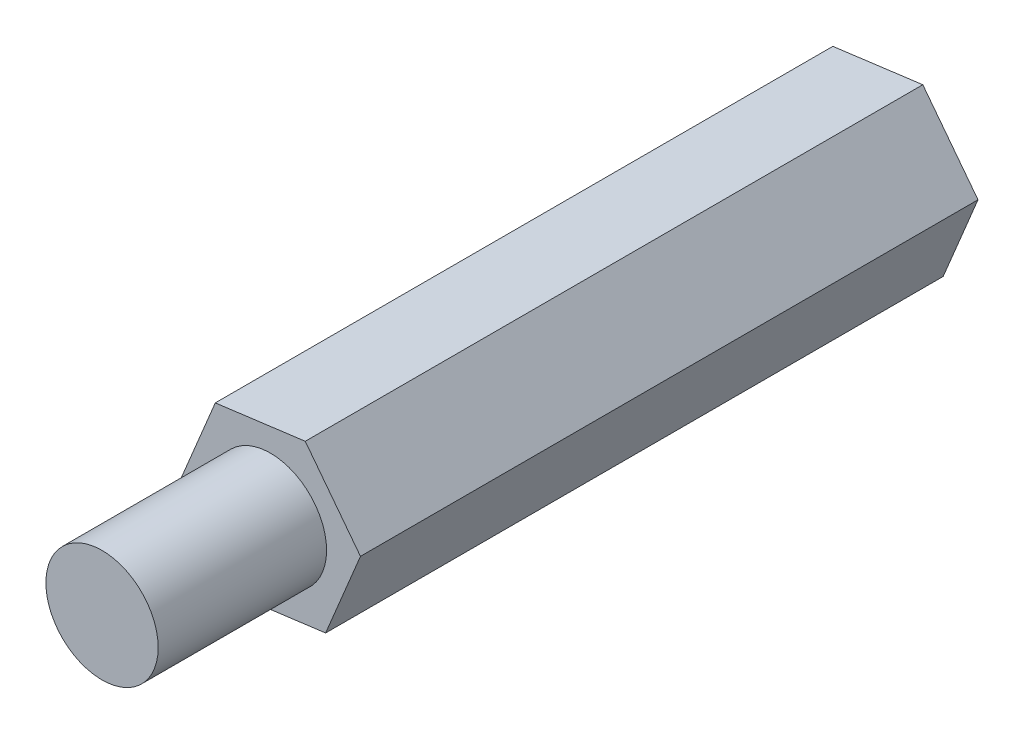
ISO-10303-21;
HEADER;
FILE_DESCRIPTION(('STEP AP214'),'2;1');
FILE_NAME('part.step','',(''),(''),'','','');
FILE_SCHEMA(('AUTOMOTIVE_DESIGN { 1 0 10303 214 1 1 1 1 }'));
ENDSEC;
DATA;
#1=APPLICATION_CONTEXT('core data for automotive mechanical design processes');
#2=APPLICATION_PROTOCOL_DEFINITION('international standard','automotive_design',2000,#1);
#3=PRODUCT_CONTEXT('',#1,'mechanical');
#4=PRODUCT('Part','Part','',(#3));
#5=PRODUCT_RELATED_PRODUCT_CATEGORY('part','',(#4));
#6=PRODUCT_DEFINITION_FORMATION('','',#4);
#7=PRODUCT_DEFINITION_CONTEXT('part definition',#1,'design');
#8=PRODUCT_DEFINITION('design','',#6,#7);
#9=PRODUCT_DEFINITION_SHAPE('','',#8);
#10=(LENGTH_UNIT() NAMED_UNIT(*) SI_UNIT(.MILLI.,.METRE.));
#11=(NAMED_UNIT(*) PLANE_ANGLE_UNIT() SI_UNIT($,.RADIAN.));
#12=(NAMED_UNIT(*) SI_UNIT($,.STERADIAN.) SOLID_ANGLE_UNIT());
#13=UNCERTAINTY_MEASURE_WITH_UNIT(LENGTH_MEASURE(1.E-05),#10,'distance_accuracy_value','');
#14=(GEOMETRIC_REPRESENTATION_CONTEXT(3) GLOBAL_UNCERTAINTY_ASSIGNED_CONTEXT((#13)) GLOBAL_UNIT_ASSIGNED_CONTEXT((#10,
#11,#12)) REPRESENTATION_CONTEXT('',''));
#15=CARTESIAN_POINT('',(0.,0.,0.));
#16=DIRECTION('',(0.,0.,1.));
#17=DIRECTION('',(1.,0.,0.));
#18=AXIS2_PLACEMENT_3D('',#15,#16,#17);
#19=CARTESIAN_POINT('',(-0.620107089526778,-1.49291678631194,11.));
#20=DIRECTION('',(-0.129551152997213,0.991572740023188,0.));
#21=DIRECTION('',(-0.991572740023188,-0.129551152997213,0.));
#22=AXIS2_PLACEMENT_3D('',#19,#20,#21);
#23=PLANE('',#22);
#24=DIRECTION('',(0.991572740023188,0.129551152997213,0.));
#25=VECTOR('',#24,1.);
#26=CARTESIAN_POINT('',(-0.620107089526778,-1.49291678631194,0.));
#27=LINE('',#26,#25);
#28=CARTESIAN_POINT('',(-0.620107089526778,-1.49291678631194,0.));
#29=VERTEX_POINT('',#28);
#30=CARTESIAN_POINT('',(0.982850317918974,-1.28348688575299,0.));
#31=VERTEX_POINT('',#30);
#32=EDGE_CURVE('E123',#29,#31,#27,.T.);
#33=ORIENTED_EDGE('',*,*,#32,.T.);
#34=DIRECTION('',(0.,0.,-1.));
#35=VECTOR('',#34,1.);
#36=CARTESIAN_POINT('',(0.982850317918974,-1.28348688575299,11.));
#37=LINE('',#36,#35);
#38=CARTESIAN_POINT('',(0.982850317918974,-1.28348688575299,11.));
#39=VERTEX_POINT('',#38);
#40=EDGE_CURVE('E40',#39,#31,#37,.T.);
#41=ORIENTED_EDGE('',*,*,#40,.F.);
#42=DIRECTION('',(0.991572740023188,0.129551152997213,0.));
#43=VECTOR('',#42,1.);
#44=CARTESIAN_POINT('',(-0.620107089526778,-1.49291678631194,11.));
#45=LINE('',#44,#43);
#46=CARTESIAN_POINT('',(-0.620107089526778,-1.49291678631194,11.));
#47=VERTEX_POINT('',#46);
#48=EDGE_CURVE('E134',#47,#39,#45,.T.);
#49=ORIENTED_EDGE('',*,*,#48,.F.);
#50=DIRECTION('',(0.,0.,-1.));
#51=VECTOR('',#50,1.);
#52=CARTESIAN_POINT('',(-0.620107089526778,-1.49291678631194,11.));
#53=LINE('',#52,#51);
#54=EDGE_CURVE('E119',#47,#29,#53,.T.);
#55=ORIENTED_EDGE('',*,*,#54,.T.);
#56=EDGE_LOOP('',(#33,#41,#49,#55));
#57=FACE_BOUND('',#56,.T.);
#58=ADVANCED_FACE('F37',(#57),#23,.F.);
#59=CARTESIAN_POINT('',(0.982850317918974,-1.28348688575299,11.));
#60=DIRECTION('',(-0.92350275905883,0.383591780426443,0.));
#61=DIRECTION('',(-0.383591780426443,-0.92350275905883,0.));
#62=AXIS2_PLACEMENT_3D('',#59,#60,#61);
#63=PLANE('',#62);
#64=DIRECTION('',(0.383591780426443,0.92350275905883,0.));
#65=VECTOR('',#64,1.);
#66=CARTESIAN_POINT('',(0.982850317918974,-1.28348688575299,0.));
#67=LINE('',#66,#65);
#68=CARTESIAN_POINT('',(1.60295740744575,0.209429900558949,0.));
#69=VERTEX_POINT('',#68);
#70=EDGE_CURVE('E126',#31,#69,#67,.T.);
#71=ORIENTED_EDGE('',*,*,#70,.T.);
#72=DIRECTION('',(0.,0.,-1.));
#73=VECTOR('',#72,1.);
#74=CARTESIAN_POINT('',(1.60295740744575,0.209429900558949,11.));
#75=LINE('',#74,#73);
#76=CARTESIAN_POINT('',(1.60295740744575,0.209429900558949,11.));
#77=VERTEX_POINT('',#76);
#78=EDGE_CURVE('E137',#77,#69,#75,.T.);
#79=ORIENTED_EDGE('',*,*,#78,.F.);
#80=DIRECTION('',(0.383591780426443,0.92350275905883,0.));
#81=VECTOR('',#80,1.);
#82=CARTESIAN_POINT('',(0.982850317918974,-1.28348688575299,11.));
#83=LINE('',#82,#81);
#84=EDGE_CURVE('E92',#39,#77,#83,.T.);
#85=ORIENTED_EDGE('',*,*,#84,.F.);
#86=ORIENTED_EDGE('',*,*,#40,.T.);
#87=EDGE_LOOP('',(#71,#79,#85,#86));
#88=FACE_BOUND('',#87,.T.);
#89=ADVANCED_FACE('F142',(#88),#63,.F.);
#90=CARTESIAN_POINT('',(1.60295740744575,0.209429900558949,11.));
#91=DIRECTION('',(-0.793951606061617,-0.607980959596745,0.));
#92=DIRECTION('',(0.607980959596745,-0.793951606061617,0.));
#93=AXIS2_PLACEMENT_3D('',#90,#91,#92);
#94=PLANE('',#93);
#95=DIRECTION('',(-0.607980959596745,0.793951606061617,0.));
#96=VECTOR('',#95,1.);
#97=CARTESIAN_POINT('',(1.60295740744575,0.209429900558949,0.));
#98=LINE('',#97,#96);
#99=CARTESIAN_POINT('',(0.620107089526777,1.49291678631194,0.));
#100=VERTEX_POINT('',#99);
#101=EDGE_CURVE('E129',#69,#100,#98,.T.);
#102=ORIENTED_EDGE('',*,*,#101,.T.);
#103=DIRECTION('',(0.,0.,-1.));
#104=VECTOR('',#103,1.);
#105=CARTESIAN_POINT('',(0.620107089526777,1.49291678631194,11.));
#106=LINE('',#105,#104);
#107=CARTESIAN_POINT('',(0.620107089526777,1.49291678631194,11.));
#108=VERTEX_POINT('',#107);
#109=EDGE_CURVE('E114',#108,#100,#106,.T.);
#110=ORIENTED_EDGE('',*,*,#109,.F.);
#111=DIRECTION('',(-0.607980959596745,0.793951606061617,0.));
#112=VECTOR('',#111,1.);
#113=CARTESIAN_POINT('',(1.60295740744575,0.209429900558949,11.));
#114=LINE('',#113,#112);
#115=EDGE_CURVE('E105',#77,#108,#114,.T.);
#116=ORIENTED_EDGE('',*,*,#115,.F.);
#117=ORIENTED_EDGE('',*,*,#78,.T.);
#118=EDGE_LOOP('',(#102,#110,#116,#117));
#119=FACE_BOUND('',#118,.T.);
#120=ADVANCED_FACE('F148',(#119),#94,.F.);
#121=CARTESIAN_POINT('',(0.620107089526777,1.49291678631194,11.));
#122=DIRECTION('',(0.129551152997213,-0.991572740023188,0.));
#123=DIRECTION('',(0.991572740023188,0.129551152997213,0.));
#124=AXIS2_PLACEMENT_3D('',#121,#122,#123);
#125=PLANE('',#124);
#126=DIRECTION('',(-0.991572740023188,-0.129551152997213,0.));
#127=VECTOR('',#126,1.);
#128=CARTESIAN_POINT('',(0.620107089526777,1.49291678631194,0.));
#129=LINE('',#128,#127);
#130=CARTESIAN_POINT('',(-0.982850317918973,1.28348688575299,0.));
#131=VERTEX_POINT('',#130);
#132=EDGE_CURVE('E113',#100,#131,#129,.T.);
#133=ORIENTED_EDGE('',*,*,#132,.T.);
#134=DIRECTION('',(0.,0.,-1.));
#135=VECTOR('',#134,1.);
#136=CARTESIAN_POINT('',(-0.982850317918973,1.28348688575299,11.));
#137=LINE('',#136,#135);
#138=CARTESIAN_POINT('',(-0.982850317918973,1.28348688575299,11.));
#139=VERTEX_POINT('',#138);
#140=EDGE_CURVE('E110',#139,#131,#137,.T.);
#141=ORIENTED_EDGE('',*,*,#140,.F.);
#142=DIRECTION('',(-0.991572740023188,-0.129551152997213,0.));
#143=VECTOR('',#142,1.);
#144=CARTESIAN_POINT('',(0.620107089526777,1.49291678631194,11.));
#145=LINE('',#144,#143);
#146=EDGE_CURVE('E99',#108,#139,#145,.T.);
#147=ORIENTED_EDGE('',*,*,#146,.F.);
#148=ORIENTED_EDGE('',*,*,#109,.T.);
#149=EDGE_LOOP('',(#133,#141,#147,#148));
#150=FACE_BOUND('',#149,.T.);
#151=ADVANCED_FACE('F111',(#150),#125,.F.);
#152=CARTESIAN_POINT('',(-0.982850317918973,1.28348688575299,11.));
#153=DIRECTION('',(0.92350275905883,-0.383591780426443,0.));
#154=DIRECTION('',(0.383591780426443,0.92350275905883,0.));
#155=AXIS2_PLACEMENT_3D('',#152,#153,#154);
#156=PLANE('',#155);
#157=DIRECTION('',(-0.383591780426443,-0.92350275905883,0.));
#158=VECTOR('',#157,1.);
#159=CARTESIAN_POINT('',(-0.982850317918973,1.28348688575299,0.));
#160=LINE('',#159,#158);
#161=CARTESIAN_POINT('',(-1.60295740744575,-0.209429900558948,0.));
#162=VERTEX_POINT('',#161);
#163=EDGE_CURVE('E77',#131,#162,#160,.T.);
#164=ORIENTED_EDGE('',*,*,#163,.T.);
#165=DIRECTION('',(0.,0.,-1.));
#166=VECTOR('',#165,1.);
#167=CARTESIAN_POINT('',(-1.60295740744575,-0.209429900558948,11.));
#168=LINE('',#167,#166);
#169=CARTESIAN_POINT('',(-1.60295740744575,-0.209429900558948,11.));
#170=VERTEX_POINT('',#169);
#171=EDGE_CURVE('E115',#170,#162,#168,.T.);
#172=ORIENTED_EDGE('',*,*,#171,.F.);
#173=DIRECTION('',(-0.383591780426443,-0.92350275905883,0.));
#174=VECTOR('',#173,1.);
#175=CARTESIAN_POINT('',(-0.982850317918973,1.28348688575299,11.));
#176=LINE('',#175,#174);
#177=EDGE_CURVE('E103',#139,#170,#176,.T.);
#178=ORIENTED_EDGE('',*,*,#177,.F.);
#179=ORIENTED_EDGE('',*,*,#140,.T.);
#180=EDGE_LOOP('',(#164,#172,#178,#179));
#181=FACE_BOUND('',#180,.T.);
#182=ADVANCED_FACE('F117',(#181),#156,.F.);
#183=CARTESIAN_POINT('',(-1.60295740744575,-0.209429900558948,11.));
#184=DIRECTION('',(0.793951606061617,0.607980959596745,0.));
#185=DIRECTION('',(-0.607980959596745,0.793951606061618,0.));
#186=AXIS2_PLACEMENT_3D('',#183,#184,#185);
#187=PLANE('',#186);
#188=DIRECTION('',(0.607980959596745,-0.793951606061617,0.));
#189=VECTOR('',#188,1.);
#190=CARTESIAN_POINT('',(-1.60295740744575,-0.209429900558948,0.));
#191=LINE('',#190,#189);
#192=EDGE_CURVE('E83',#162,#29,#191,.T.);
#193=ORIENTED_EDGE('',*,*,#192,.T.);
#194=ORIENTED_EDGE('',*,*,#54,.F.);
#195=DIRECTION('',(0.607980959596745,-0.793951606061617,0.));
#196=VECTOR('',#195,1.);
#197=CARTESIAN_POINT('',(-1.60295740744575,-0.209429900558948,11.));
#198=LINE('',#197,#196);
#199=EDGE_CURVE('E54',#170,#47,#198,.T.);
#200=ORIENTED_EDGE('',*,*,#199,.F.);
#201=ORIENTED_EDGE('',*,*,#171,.T.);
#202=EDGE_LOOP('',(#193,#194,#200,#201));
#203=FACE_BOUND('',#202,.T.);
#204=ADVANCED_FACE('F179',(#203),#187,.F.);
#205=CARTESIAN_POINT('',(0.,0.,11.));
#206=DIRECTION('',(0.,0.,1.));
#207=DIRECTION('',(1.,0.,0.));
#208=AXIS2_PLACEMENT_3D('',#205,#206,#207);
#209=PLANE('',#208);
#210=CARTESIAN_POINT('',(0.,0.,11.));
#211=DIRECTION('',(0.,0.,1.));
#212=DIRECTION('',(1.,0.,0.));
#213=AXIS2_PLACEMENT_3D('',#210,#211,#212);
#214=CIRCLE('',#213,1.);
#215=CARTESIAN_POINT('',(1.,0.,11.));
#216=VERTEX_POINT('',#215);
#217=EDGE_CURVE('E11',#216,#216,#214,.T.);
#218=ORIENTED_EDGE('',*,*,#217,.F.);
#219=EDGE_LOOP('',(#218));
#220=FACE_BOUND('',#219,.T.);
#221=ORIENTED_EDGE('',*,*,#48,.T.);
#222=ORIENTED_EDGE('',*,*,#84,.T.);
#223=ORIENTED_EDGE('',*,*,#115,.T.);
#224=ORIENTED_EDGE('',*,*,#146,.T.);
#225=ORIENTED_EDGE('',*,*,#177,.T.);
#226=ORIENTED_EDGE('',*,*,#199,.T.);
#227=EDGE_LOOP('',(#221,#222,#223,#224,#225,#226));
#228=FACE_BOUND('',#227,.T.);
#229=ADVANCED_FACE('F101',(#220,#228),#209,.T.);
#230=CARTESIAN_POINT('',(0.,0.,0.));
#231=DIRECTION('',(0.,0.,1.));
#232=DIRECTION('',(1.,0.,0.));
#233=AXIS2_PLACEMENT_3D('',#230,#231,#232);
#234=PLANE('',#233);
#235=CARTESIAN_POINT('',(0.,0.,0.));
#236=DIRECTION('',(0.,0.,-1.));
#237=DIRECTION('',(-1.,0.,0.));
#238=AXIS2_PLACEMENT_3D('',#235,#236,#237);
#239=CIRCLE('',#238,1.);
#240=CARTESIAN_POINT('',(-1.,0.,0.));
#241=VERTEX_POINT('',#240);
#242=EDGE_CURVE('E155',#241,#241,#239,.T.);
#243=ORIENTED_EDGE('',*,*,#242,.F.);
#244=EDGE_LOOP('',(#243));
#245=FACE_BOUND('',#244,.T.);
#246=ORIENTED_EDGE('',*,*,#32,.F.);
#247=ORIENTED_EDGE('',*,*,#192,.F.);
#248=ORIENTED_EDGE('',*,*,#163,.F.);
#249=ORIENTED_EDGE('',*,*,#132,.F.);
#250=ORIENTED_EDGE('',*,*,#101,.F.);
#251=ORIENTED_EDGE('',*,*,#70,.F.);
#252=EDGE_LOOP('',(#246,#247,#248,#249,#250,#251));
#253=FACE_BOUND('',#252,.T.);
#254=ADVANCED_FACE('F147',(#245,#253),#234,.F.);
#255=CARTESIAN_POINT('',(0.,0.,14.));
#256=DIRECTION('',(0.,0.,-1.));
#257=DIRECTION('',(-1.,0.,0.));
#258=AXIS2_PLACEMENT_3D('',#255,#256,#257);
#259=CYLINDRICAL_SURFACE('',#258,1.);
#260=CARTESIAN_POINT('',(0.,0.,14.));
#261=DIRECTION('',(0.,0.,1.));
#262=DIRECTION('',(1.,0.,0.));
#263=AXIS2_PLACEMENT_3D('',#260,#261,#262);
#264=CIRCLE('',#263,1.);
#265=CARTESIAN_POINT('',(1.,0.,14.));
#266=VERTEX_POINT('',#265);
#267=EDGE_CURVE('E127',#266,#266,#264,.T.);
#268=ORIENTED_EDGE('',*,*,#267,.F.);
#269=EDGE_LOOP('',(#268));
#270=FACE_BOUND('',#269,.T.);
#271=ORIENTED_EDGE('',*,*,#217,.T.);
#272=EDGE_LOOP('',(#271));
#273=FACE_BOUND('',#272,.T.);
#274=ADVANCED_FACE('F171',(#270,#273),#259,.T.);
#275=CARTESIAN_POINT('',(0.,0.,14.));
#276=DIRECTION('',(0.,0.,1.));
#277=DIRECTION('',(1.,0.,0.));
#278=AXIS2_PLACEMENT_3D('',#275,#276,#277);
#279=PLANE('',#278);
#280=ORIENTED_EDGE('',*,*,#267,.T.);
#281=EDGE_LOOP('',(#280));
#282=FACE_BOUND('',#281,.T.);
#283=ADVANCED_FACE('F166',(#282),#279,.T.);
#284=CARTESIAN_POINT('',(0.,0.,3.));
#285=DIRECTION('',(0.,0.,-1.));
#286=DIRECTION('',(-1.,0.,0.));
#287=AXIS2_PLACEMENT_3D('',#284,#285,#286);
#288=CYLINDRICAL_SURFACE('',#287,1.);
#289=CARTESIAN_POINT('',(0.,0.,3.));
#290=DIRECTION('',(0.,0.,-1.));
#291=DIRECTION('',(-1.,0.,0.));
#292=AXIS2_PLACEMENT_3D('',#289,#290,#291);
#293=CIRCLE('',#292,1.);
#294=CARTESIAN_POINT('',(-1.,0.,3.));
#295=VERTEX_POINT('',#294);
#296=EDGE_CURVE('E154',#295,#295,#293,.T.);
#297=ORIENTED_EDGE('',*,*,#296,.F.);
#298=EDGE_LOOP('',(#297));
#299=FACE_BOUND('',#298,.T.);
#300=ORIENTED_EDGE('',*,*,#242,.T.);
#301=EDGE_LOOP('',(#300));
#302=FACE_BOUND('',#301,.T.);
#303=ADVANCED_FACE('F163',(#299,#302),#288,.F.);
#304=CARTESIAN_POINT('',(0.,0.,3.));
#305=DIRECTION('',(0.,0.,-1.));
#306=DIRECTION('',(-1.,0.,0.));
#307=AXIS2_PLACEMENT_3D('',#304,#305,#306);
#308=PLANE('',#307);
#309=ORIENTED_EDGE('',*,*,#296,.T.);
#310=EDGE_LOOP('',(#309));
#311=FACE_BOUND('',#310,.T.);
#312=ADVANCED_FACE('F161',(#311),#308,.T.);
#313=CLOSED_SHELL('',(#58,#89,#120,#151,#182,#204,#229,#254,#274,#283,#303,#312));
#314=MANIFOLD_SOLID_BREP('B2',#313);
#315=ADVANCED_BREP_SHAPE_REPRESENTATION('',(#18,#314),#14);
#316=SHAPE_DEFINITION_REPRESENTATION(#9,#315);
ENDSEC;
END-ISO-10303-21;
